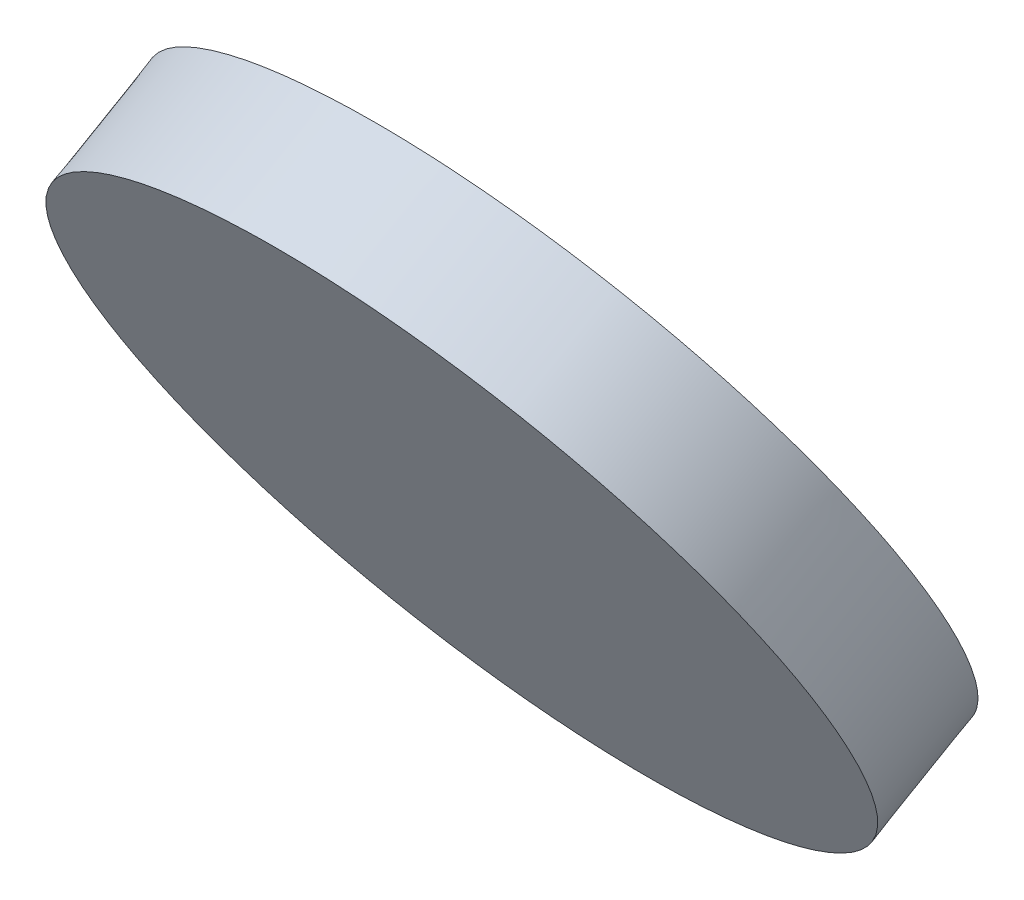
ISO-10303-21;
HEADER;
FILE_DESCRIPTION(('STEP AP214'),'2;1');
FILE_NAME('part.step','',(''),(''),'','','');
FILE_SCHEMA(('AUTOMOTIVE_DESIGN { 1 0 10303 214 1 1 1 1 }'));
ENDSEC;
DATA;
#1=APPLICATION_CONTEXT('core data for automotive mechanical design processes');
#2=APPLICATION_PROTOCOL_DEFINITION('international standard','automotive_design',2000,#1);
#3=PRODUCT_CONTEXT('',#1,'mechanical');
#4=PRODUCT('Part','Part','',(#3));
#5=PRODUCT_RELATED_PRODUCT_CATEGORY('part','',(#4));
#6=PRODUCT_DEFINITION_FORMATION('','',#4);
#7=PRODUCT_DEFINITION_CONTEXT('part definition',#1,'design');
#8=PRODUCT_DEFINITION('design','',#6,#7);
#9=PRODUCT_DEFINITION_SHAPE('','',#8);
#10=(LENGTH_UNIT() NAMED_UNIT(*) SI_UNIT(.MILLI.,.METRE.));
#11=(NAMED_UNIT(*) PLANE_ANGLE_UNIT() SI_UNIT($,.RADIAN.));
#12=(NAMED_UNIT(*) SI_UNIT($,.STERADIAN.) SOLID_ANGLE_UNIT());
#13=UNCERTAINTY_MEASURE_WITH_UNIT(LENGTH_MEASURE(1.E-05),#10,'distance_accuracy_value','');
#14=(GEOMETRIC_REPRESENTATION_CONTEXT(3) GLOBAL_UNCERTAINTY_ASSIGNED_CONTEXT((#13)) GLOBAL_UNIT_ASSIGNED_CONTEXT((#10,
#11,#12)) REPRESENTATION_CONTEXT('',''));
#15=CARTESIAN_POINT('',(0.,0.,0.));
#16=DIRECTION('',(0.,0.,1.));
#17=DIRECTION('',(1.,0.,0.));
#18=AXIS2_PLACEMENT_3D('',#15,#16,#17);
#19=CARTESIAN_POINT('',(-12.5,13.3879679238206,-41.0328048076007));
#20=CARTESIAN_POINT('',(-12.3317700207924,13.3879679238206,-41.0328048076007));
#21=CARTESIAN_POINT('',(-11.9953100623771,13.3300082670677,-41.0662678310291));
#22=CARTESIAN_POINT('',(-11.5674545927316,13.0824255601822,-41.2092097734962));
#23=CARTESIAN_POINT('',(-11.2815707077975,12.7118918543211,-41.4231375083189));
#24=CARTESIAN_POINT('',(-11.1811816375123,12.2748175473052,-41.6754824771303));
#25=CARTESIAN_POINT('',(-11.2815707077975,11.8377432402894,-41.9278274459418));
#26=CARTESIAN_POINT('',(-11.5674545927316,11.4672095344283,-42.1417551807645));
#27=CARTESIAN_POINT('',(-11.9953100623771,11.2196268275428,-42.2846971232316));
#28=CARTESIAN_POINT('',(-12.5,11.1326873424135,-42.3348916583742));
#29=CARTESIAN_POINT('',(-13.0046899376229,11.2196268275428,-42.2846971232316));
#30=CARTESIAN_POINT('',(-13.4325454072684,11.4672095344283,-42.1417551807646));
#31=CARTESIAN_POINT('',(-13.7184292922025,11.8377432402894,-41.9278274459418));
#32=CARTESIAN_POINT('',(-13.8188183624877,12.2748175473052,-41.6754824771303));
#33=CARTESIAN_POINT('',(-13.7184292922025,12.7118918543211,-41.4231375083189));
#34=CARTESIAN_POINT('',(-13.4325454072684,13.0824255601822,-41.2092097734962));
#35=CARTESIAN_POINT('',(-13.0046899376229,13.3300082670677,-41.0662678310291));
#36=CARTESIAN_POINT('',(-12.6682299792076,13.3879679238206,-41.0328048076007));
#37=CARTESIAN_POINT('',(-12.5,13.3879679238206,-41.0328048076007));
#38=B_SPLINE_CURVE_WITH_KNOTS('',3,(#19,#20,#21,#22,#23,#24,#25,#26,#27,#28,#29,#30,#31,#32,#33,
#34,#35,#36,#37),.UNSPECIFIED.,.T.,.F.,(4,1,1,1,1,1,1,1,1,1,1,1,1,1,1,1,4),(0.,
0.0624999999999999,0.125,0.1875,0.25,0.312499999999999,0.375,0.4375,0.5,0.5625,
0.624999999999999,0.6875,0.75,0.8125,0.875,0.9375,1.),.UNSPECIFIED.);
#39=DIRECTION('',(0.,0.499999999999995,-0.866025403784442));
#40=VECTOR('',#39,1.);
#41=SURFACE_OF_LINEAR_EXTRUSION('',#38,#40);
#42=CARTESIAN_POINT('',(-12.5,13.3879679238206,-41.0328048076007));
#43=CARTESIAN_POINT('',(-12.3317700207924,13.3879679238206,-41.0328048076007));
#44=CARTESIAN_POINT('',(-11.9953100623771,13.3300082670677,-41.0662678310291));
#45=CARTESIAN_POINT('',(-11.5674545927316,13.0824255601822,-41.2092097734962));
#46=CARTESIAN_POINT('',(-11.2815707077975,12.7118918543211,-41.4231375083189));
#47=CARTESIAN_POINT('',(-11.1811816375123,12.2748175473052,-41.6754824771303));
#48=CARTESIAN_POINT('',(-11.2815707077975,11.8377432402894,-41.9278274459418));
#49=CARTESIAN_POINT('',(-11.5674545927316,11.4672095344283,-42.1417551807645));
#50=CARTESIAN_POINT('',(-11.9953100623771,11.2196268275428,-42.2846971232316));
#51=CARTESIAN_POINT('',(-12.5,11.1326873424135,-42.3348916583742));
#52=CARTESIAN_POINT('',(-13.0046899376229,11.2196268275428,-42.2846971232316));
#53=CARTESIAN_POINT('',(-13.4325454072684,11.4672095344283,-42.1417551807646));
#54=CARTESIAN_POINT('',(-13.7184292922025,11.8377432402894,-41.9278274459418));
#55=CARTESIAN_POINT('',(-13.8188183624877,12.2748175473052,-41.6754824771303));
#56=CARTESIAN_POINT('',(-13.7184292922025,12.7118918543211,-41.4231375083189));
#57=CARTESIAN_POINT('',(-13.4325454072684,13.0824255601822,-41.2092097734962));
#58=CARTESIAN_POINT('',(-13.0046899376229,13.3300082670677,-41.0662678310291));
#59=CARTESIAN_POINT('',(-12.6682299792076,13.3879679238206,-41.0328048076007));
#60=CARTESIAN_POINT('',(-12.5,13.3879679238206,-41.0328048076007));
#61=B_SPLINE_CURVE_WITH_KNOTS('',3,(#42,#43,#44,#45,#46,#47,#48,#49,#50,#51,#52,#53,#54,#55,#56,
#57,#58,#59,#60),.UNSPECIFIED.,.T.,.F.,(4,1,1,1,1,1,1,1,1,1,1,1,1,1,1,1,4),(0.,
0.0624999999999999,0.125,0.1875,0.25,0.312499999999999,0.375,0.4375,0.5,0.5625,
0.624999999999999,0.6875,0.75,0.8125,0.875,0.9375,1.),.UNSPECIFIED.);
#62=CARTESIAN_POINT('',(-12.5,13.3879679238206,-41.0328048076007));
#63=VERTEX_POINT('',#62);
#64=EDGE_CURVE('E10',#63,#63,#61,.T.);
#65=ORIENTED_EDGE('',*,*,#64,.T.);
#66=EDGE_LOOP('',(#65));
#67=FACE_BOUND('',#66,.T.);
#68=CARTESIAN_POINT('',(-12.5,13.5879679238206,-41.3792149691145));
#69=CARTESIAN_POINT('',(-12.5210292435893,13.5879679370051,-41.3792149615024));
#70=CARTESIAN_POINT('',(-12.5420580506909,13.5875150942108,-41.3794764104116));
#71=CARTESIAN_POINT('',(-12.5840656469514,13.5857124585183,-41.3805171626139));
#72=CARTESIAN_POINT('',(-12.605044433095,13.5843626128516,-41.3812964963729));
#73=CARTESIAN_POINT('',(-12.6469017924796,13.5807746122206,-41.3833680295031));
#74=CARTESIAN_POINT('',(-12.6677803587443,13.578536396298,-41.3846602640685));
#75=CARTESIAN_POINT('',(-12.7093873858979,13.5731802652805,-41.3877526277533));
#76=CARTESIAN_POINT('',(-12.7301158402734,13.5700623122453,-41.3895527787775));
#77=CARTESIAN_POINT('',(-12.7713726611837,13.5629552823521,-41.3936560243994));
#78=CARTESIAN_POINT('',(-12.7919010277185,13.5589662054942,-41.3959591189972));
#79=CARTESIAN_POINT('',(-12.832707709252,13.5501254880213,-41.40106330961));
#80=CARTESIAN_POINT('',(-12.8529860349978,13.5452738846176,-41.4038643841411));
#81=CARTESIAN_POINT('',(-12.8932426430212,13.5347166816437,-41.40995958812));
#82=CARTESIAN_POINT('',(-12.9132209457939,13.529011140702,-41.4132536837186));
#83=CARTESIAN_POINT('',(-12.9528275830444,13.5167546200185,-41.4203299892345));
#84=CARTESIAN_POINT('',(-12.9724559380415,13.5102036900331,-41.424112170425));
#85=CARTESIAN_POINT('',(-13.0113124478785,13.4962651035168,-41.4321596171023));
#86=CARTESIAN_POINT('',(-13.0305406027184,13.4888774469859,-41.4364248825891));
#87=CARTESIAN_POINT('',(-13.06855413176,13.4732901029195,-41.4454242398818));
#88=CARTESIAN_POINT('',(-13.0873394798451,13.4650903676354,-41.4501583592553));
#89=CARTESIAN_POINT('',(-13.1244251203754,13.4479034004617,-41.4600812593796));
#90=CARTESIAN_POINT('',(-13.1427253794428,13.4389161145649,-41.4652700713115));
#91=CARTESIAN_POINT('',(-13.1787984767248,13.4201785584249,-41.4760882043928));
#92=CARTESIAN_POINT('',(-13.1965712921558,13.4104282552884,-41.4817175445334));
#93=CARTESIAN_POINT('',(-13.2315471338735,13.3901891460976,-41.4934025996728));
#94=CARTESIAN_POINT('',(-13.2487501601601,13.3797003400433,-41.4994583146718));
#95=CARTESIAN_POINT('',(-13.2825440403118,13.3580086937487,-41.5119819924991));
#96=CARTESIAN_POINT('',(-13.2991349205488,13.3468058843255,-41.5184499375353));
#97=CARTESIAN_POINT('',(-13.331662109414,13.3237107142865,-41.5317839401743));
#98=CARTESIAN_POINT('',(-13.3475984628843,13.3118184010442,-41.538649970426));
#99=CARTESIAN_POINT('',(-13.3787742546724,13.287368675224,-41.5527660262099));
#100=CARTESIAN_POINT('',(-13.3940137339341,13.2748113018148,-41.560016029128));
#101=CARTESIAN_POINT('',(-13.4237532190322,13.2490561522244,-41.5748857716771));
#102=CARTESIAN_POINT('',(-13.4382532248685,13.2358583760433,-41.5825055113079));
#103=CARTESIAN_POINT('',(-13.4664853364362,13.2088593483717,-41.598093407202));
#104=CARTESIAN_POINT('',(-13.4802173969397,13.1950580614227,-41.6060615839371));
#105=CARTESIAN_POINT('',(-13.5068854022177,13.1668886895517,-41.6223251783698));
#106=CARTESIAN_POINT('',(-13.5198212922901,13.1525205657954,-41.6306206184882));
#107=CARTESIAN_POINT('',(-13.5448686479447,13.1232542070916,-41.6475175585641));
#108=CARTESIAN_POINT('',(-13.5569800779426,13.1083559493053,-41.6561190717074));
#109=CARTESIAN_POINT('',(-13.5803501882216,13.0780659818592,-41.6736069925662));
#110=CARTESIAN_POINT('',(-13.5916088685026,13.0626742721992,-41.6824934002817));
#111=CARTESIAN_POINT('',(-13.6132451346653,13.0314340535596,-41.7005299489228));
#112=CARTESIAN_POINT('',(-13.623622758529,13.015585564311,-41.7096800784567));
#113=CARTESIAN_POINT('',(-13.6434685587776,12.983468457497,-41.7282228987214));
#114=CARTESIAN_POINT('',(-13.6529367975248,12.9671998688375,-41.7376155727632));
#115=CARTESIAN_POINT('',(-13.67093551211,12.9342791869969,-41.7566223372858));
#116=CARTESIAN_POINT('',(-13.6794660430833,12.9176271164334,-41.7662364147082));
#117=CARTESIAN_POINT('',(-13.6955609364387,12.8839763918238,-41.78566466962));
#118=CARTESIAN_POINT('',(-13.7031252988208,12.8669777377776,-41.7954788471094));
#119=CARTESIAN_POINT('',(-13.7172779098496,12.8326773837169,-41.8152821657597));
#120=CARTESIAN_POINT('',(-13.7238661010426,12.8153756659321,-41.8252713171802));
#121=CARTESIAN_POINT('',(-13.7360565090117,12.7805124208753,-41.8453996210986));
#122=CARTESIAN_POINT('',(-13.7416586580894,12.7629508758539,-41.855538783844));
#123=CARTESIAN_POINT('',(-13.7518670392729,12.7276112523987,-41.875942124959));
#124=CARTESIAN_POINT('',(-13.7564732284109,12.7098331646577,-41.8862063087019));
#125=CARTESIAN_POINT('',(-13.7646797198118,12.6741037119205,-41.9068347178577));
#126=CARTESIAN_POINT('',(-13.7682800220747,12.6561523469245,-41.9171989432705));
#127=CARTESIAN_POINT('',(-13.7744647488583,12.6201195960344,-41.9380024616965));
#128=CARTESIAN_POINT('',(-13.7770492171889,12.6020382157818,-41.9484417514527));
#129=CARTESIAN_POINT('',(-13.7811922856357,12.5657887105628,-41.9693704130489));
#130=CARTESIAN_POINT('',(-13.7827509561402,12.5476205916345,-41.9798597814028));
#131=CARTESIAN_POINT('',(-13.7848324523857,12.5112408291569,-42.0008636470623));
#132=CARTESIAN_POINT('',(-13.7853553390593,12.4930291882311,-42.0113781428532));
#133=CARTESIAN_POINT('',(-13.7853553390593,12.4566059063794,-42.032407134435));
#134=CARTESIAN_POINT('',(-13.7848324523857,12.4383942654536,-42.042921630226));
#135=CARTESIAN_POINT('',(-13.7827509561402,12.402014502976,-42.0639254958854));
#136=CARTESIAN_POINT('',(-13.7811922856357,12.3838463840476,-42.0744148642394));
#137=CARTESIAN_POINT('',(-13.7770492171889,12.3475968788287,-42.0953435258355));
#138=CARTESIAN_POINT('',(-13.7744647488583,12.3295154985761,-42.1057828155917));
#139=CARTESIAN_POINT('',(-13.7682800220747,12.293482747686,-42.1265863340177));
#140=CARTESIAN_POINT('',(-13.7646797198118,12.2755313826899,-42.1369505594305));
#141=CARTESIAN_POINT('',(-13.7564732284109,12.2398019299528,-42.1575789685863));
#142=CARTESIAN_POINT('',(-13.7518670392729,12.2220238422118,-42.1678431523293));
#143=CARTESIAN_POINT('',(-13.7416586580894,12.1866842187565,-42.1882464934442));
#144=CARTESIAN_POINT('',(-13.7360565090117,12.1691226737352,-42.1983856561897));
#145=CARTESIAN_POINT('',(-13.7238661010426,12.1342594286783,-42.2185139601081));
#146=CARTESIAN_POINT('',(-13.7172779098496,12.1169577108936,-42.2285031115286));
#147=CARTESIAN_POINT('',(-13.7031252988208,12.0826573568328,-42.2483064301788));
#148=CARTESIAN_POINT('',(-13.6955609364387,12.0656587027867,-42.2581206076682));
#149=CARTESIAN_POINT('',(-13.6794660430833,12.032007978177,-42.27754886258));
#150=CARTESIAN_POINT('',(-13.67093551211,12.0153559076135,-42.2871629400024));
#151=CARTESIAN_POINT('',(-13.6529367975248,11.9824352257729,-42.306169704525));
#152=CARTESIAN_POINT('',(-13.6434685587776,11.9661666371135,-42.3155623785669));
#153=CARTESIAN_POINT('',(-13.623622758529,11.9340495302994,-42.3341051988316));
#154=CARTESIAN_POINT('',(-13.6132451346653,11.9182010410509,-42.3432553283655));
#155=CARTESIAN_POINT('',(-13.5916088685026,11.8869608224113,-42.3612918770066));
#156=CARTESIAN_POINT('',(-13.5803501882216,11.8715691127513,-42.3701782847221));
#157=CARTESIAN_POINT('',(-13.5569800779426,11.8412791453051,-42.3876662055809));
#158=CARTESIAN_POINT('',(-13.5448686479447,11.8263808875189,-42.3962677187242));
#159=CARTESIAN_POINT('',(-13.5198212922901,11.7971145288151,-42.4131646588));
#160=CARTESIAN_POINT('',(-13.5068854022177,11.7827464050587,-42.4214600989185));
#161=CARTESIAN_POINT('',(-13.4802173969397,11.7545770331877,-42.4377236933511));
#162=CARTESIAN_POINT('',(-13.4664853364362,11.7407757462388,-42.4456918700863));
#163=CARTESIAN_POINT('',(-13.4382532248685,11.7137767185672,-42.4612797659803));
#164=CARTESIAN_POINT('',(-13.4237532190322,11.7005789423861,-42.4688995056112));
#165=CARTESIAN_POINT('',(-13.3940137339341,11.6748237927957,-42.4837692481602));
#166=CARTESIAN_POINT('',(-13.3787742546724,11.6622664193864,-42.4910192510784));
#167=CARTESIAN_POINT('',(-13.3475984628843,11.6378166935663,-42.5051353068622));
#168=CARTESIAN_POINT('',(-13.331662109414,11.625924380324,-42.512001337114));
#169=CARTESIAN_POINT('',(-13.2991349205488,11.602829210285,-42.525335339753));
#170=CARTESIAN_POINT('',(-13.2825440403118,11.5916264008617,-42.5318032847892));
#171=CARTESIAN_POINT('',(-13.2487501601601,11.5699347545672,-42.5443269626165));
#172=CARTESIAN_POINT('',(-13.2315471338735,11.5594459485129,-42.5503826776154));
#173=CARTESIAN_POINT('',(-13.1965712921558,11.5392068393221,-42.5620677327549));
#174=CARTESIAN_POINT('',(-13.1787984767249,11.5294565361856,-42.5676970728955));
#175=CARTESIAN_POINT('',(-13.1427253794427,11.5107189800456,-42.5785152059768));
#176=CARTESIAN_POINT('',(-13.1244251203749,11.5017316941488,-42.5837040179086));
#177=CARTESIAN_POINT('',(-13.0873394798455,11.484544726975,-42.593626918033));
#178=CARTESIAN_POINT('',(-13.0685541317618,11.4763449916909,-42.5983610374065));
#179=CARTESIAN_POINT('',(-13.0305406027166,11.4607576476247,-42.6073603946991));
#180=CARTESIAN_POINT('',(-13.0113124478718,11.453369991094,-42.6116256601858));
#181=CARTESIAN_POINT('',(-12.9724559380482,11.439431404577,-42.6196731068635));
#182=CARTESIAN_POINT('',(-12.9528275830694,11.4328804745907,-42.6234552880545));
#183=CARTESIAN_POINT('',(-12.9132209457689,11.4206239539098,-42.6305315935689));
#184=CARTESIAN_POINT('',(-12.8932426429279,11.4149184129717,-42.6338256891654));
#185=CARTESIAN_POINT('',(-12.8529860350911,11.404361209988,-42.63992089315));
#186=CARTESIAN_POINT('',(-12.8327077096002,11.3995096065709,-42.6427219676888));
#187=CARTESIAN_POINT('',(-12.7919010273703,11.3906688891345,-42.6478261582806));
#188=CARTESIAN_POINT('',(-12.7713726598844,11.3866798123263,-42.6501292528496));
#189=CARTESIAN_POINT('',(-12.7301158415728,11.3795727822972,-42.65423249855));
#190=CARTESIAN_POINT('',(-12.7093873907472,11.3764548290763,-42.6560326496815));
#191=CARTESIAN_POINT('',(-12.6677803538952,11.3710986985662,-42.6591250130733));
#192=CARTESIAN_POINT('',(-12.6469017743828,11.3688604833367,-42.6604172472386));
#193=CARTESIAN_POINT('',(-12.6050444511905,11.3652724808121,-42.662488781462));
#194=CARTESIAN_POINT('',(-12.5840657144826,11.3639226325591,-42.6632681167142));
#195=CARTESIAN_POINT('',(-12.5420579831637,11.3621200039326,-42.6643088648369));
#196=CARTESIAN_POINT('',(-12.5210289915818,11.3616671707899,-42.6645703081738));
#197=CARTESIAN_POINT('',(-12.4789710084182,11.3616671707899,-42.6645703081738));
#198=CARTESIAN_POINT('',(-12.4579420168363,11.3621200039326,-42.664308864837));
#199=CARTESIAN_POINT('',(-12.4159342855174,11.3639226325591,-42.6632681167142));
#200=CARTESIAN_POINT('',(-12.3949555488095,11.3652724808121,-42.662488781462));
#201=CARTESIAN_POINT('',(-12.3530982256172,11.3688604833367,-42.6604172472385));
#202=CARTESIAN_POINT('',(-12.3322196461048,11.3710986985662,-42.6591250130733));
#203=CARTESIAN_POINT('',(-12.2906126092528,11.3764548290763,-42.6560326496815));
#204=CARTESIAN_POINT('',(-12.2698841584272,11.3795727822972,-42.65423249855));
#205=CARTESIAN_POINT('',(-12.2286273401156,11.3866798123263,-42.6501292528496));
#206=CARTESIAN_POINT('',(-12.2080989726297,11.3906688891345,-42.6478261582806));
#207=CARTESIAN_POINT('',(-12.1672922903998,11.3995096065709,-42.6427219676888));
#208=CARTESIAN_POINT('',(-12.1470139649089,11.404361209988,-42.63992089315));
#209=CARTESIAN_POINT('',(-12.1067573570721,11.4149184129717,-42.6338256891654));
#210=CARTESIAN_POINT('',(-12.0867790542311,11.4206239539098,-42.630531593569));
#211=CARTESIAN_POINT('',(-12.0471724169306,11.4328804745907,-42.6234552880545));
#212=CARTESIAN_POINT('',(-12.0275440619518,11.439431404577,-42.6196731068635));
#213=CARTESIAN_POINT('',(-11.9886875521282,11.453369991094,-42.6116256601858));
#214=CARTESIAN_POINT('',(-11.9694593972834,11.4607576476247,-42.6073603946991));
#215=CARTESIAN_POINT('',(-11.9314458682382,11.4763449916909,-42.5983610374065));
#216=CARTESIAN_POINT('',(-11.9126605201545,11.484544726975,-42.593626918033));
#217=CARTESIAN_POINT('',(-11.8755748796251,11.5017316941488,-42.5837040179086));
#218=CARTESIAN_POINT('',(-11.8572746205573,11.5107189800456,-42.5785152059768));
#219=CARTESIAN_POINT('',(-11.8212015232751,11.5294565361856,-42.5676970728954));
#220=CARTESIAN_POINT('',(-11.8034287078442,11.539206839322,-42.5620677327549));
#221=CARTESIAN_POINT('',(-11.7684528661265,11.5594459485129,-42.5503826776154));
#222=CARTESIAN_POINT('',(-11.7512498398399,11.5699347545672,-42.5443269626165));
#223=CARTESIAN_POINT('',(-11.7174559596882,11.5916264008617,-42.5318032847892));
#224=CARTESIAN_POINT('',(-11.7008650794512,11.602829210285,-42.5253353397529));
#225=CARTESIAN_POINT('',(-11.668337890586,11.625924380324,-42.512001337114));
#226=CARTESIAN_POINT('',(-11.6524015371157,11.6378166935663,-42.5051353068622));
#227=CARTESIAN_POINT('',(-11.6212257453276,11.6622664193864,-42.4910192510784));
#228=CARTESIAN_POINT('',(-11.6059862660658,11.6748237927957,-42.4837692481602));
#229=CARTESIAN_POINT('',(-11.5762467809678,11.7005789423861,-42.4688995056112));
#230=CARTESIAN_POINT('',(-11.5617467751315,11.7137767185672,-42.4612797659803));
#231=CARTESIAN_POINT('',(-11.5335146635638,11.7407757462388,-42.4456918700863));
#232=CARTESIAN_POINT('',(-11.5197826030603,11.7545770331877,-42.4377236933511));
#233=CARTESIAN_POINT('',(-11.4931145977823,11.7827464050587,-42.4214600989185));
#234=CARTESIAN_POINT('',(-11.4801787077099,11.7971145288151,-42.4131646588));
#235=CARTESIAN_POINT('',(-11.4551313520553,11.8263808875189,-42.3962677187242));
#236=CARTESIAN_POINT('',(-11.4430199220574,11.8412791453051,-42.3876662055809));
#237=CARTESIAN_POINT('',(-11.4196498117784,11.8715691127513,-42.3701782847221));
#238=CARTESIAN_POINT('',(-11.4083911314973,11.8869608224113,-42.3612918770066));
#239=CARTESIAN_POINT('',(-11.3867548653347,11.9182010410509,-42.3432553283655));
#240=CARTESIAN_POINT('',(-11.376377241471,11.9340495302994,-42.3341051988316));
#241=CARTESIAN_POINT('',(-11.3565314412224,11.9661666371135,-42.3155623785669));
#242=CARTESIAN_POINT('',(-11.3470632024752,11.9824352257729,-42.306169704525));
#243=CARTESIAN_POINT('',(-11.32906448789,12.0153559076135,-42.2871629400024));
#244=CARTESIAN_POINT('',(-11.3205339569167,12.032007978177,-42.27754886258));
#245=CARTESIAN_POINT('',(-11.3044390635613,12.0656587027867,-42.2581206076682));
#246=CARTESIAN_POINT('',(-11.2968747011792,12.0826573568328,-42.2483064301788));
#247=CARTESIAN_POINT('',(-11.2827220901504,12.1169577108936,-42.2285031115286));
#248=CARTESIAN_POINT('',(-11.2761338989574,12.1342594286783,-42.2185139601081));
#249=CARTESIAN_POINT('',(-11.2639434909883,12.1691226737352,-42.1983856561897));
#250=CARTESIAN_POINT('',(-11.2583413419106,12.1866842187565,-42.1882464934442));
#251=CARTESIAN_POINT('',(-11.2481329607271,12.2220238422118,-42.1678431523293));
#252=CARTESIAN_POINT('',(-11.2435267715891,12.2398019299528,-42.1575789685863));
#253=CARTESIAN_POINT('',(-11.2353202801882,12.2755313826899,-42.1369505594305));
#254=CARTESIAN_POINT('',(-11.2317199779253,12.293482747686,-42.1265863340177));
#255=CARTESIAN_POINT('',(-11.2255352511416,12.3295154985761,-42.1057828155917));
#256=CARTESIAN_POINT('',(-11.2229507828111,12.3475968788287,-42.0953435258356));
#257=CARTESIAN_POINT('',(-11.2188077143643,12.3838463840476,-42.0744148642394));
#258=CARTESIAN_POINT('',(-11.2172490438598,12.402014502976,-42.0639254958854));
#259=CARTESIAN_POINT('',(-11.2151675476143,12.4383942654536,-42.042921630226));
#260=CARTESIAN_POINT('',(-11.2146446609407,12.4566059063794,-42.032407134435));
#261=CARTESIAN_POINT('',(-11.2146446609407,12.4930291882311,-42.0113781428532));
#262=CARTESIAN_POINT('',(-11.2151675476143,12.5112408291569,-42.0008636470623));
#263=CARTESIAN_POINT('',(-11.2172490438598,12.5476205916345,-41.9798597814028));
#264=CARTESIAN_POINT('',(-11.2188077143643,12.5657887105628,-41.9693704130489));
#265=CARTESIAN_POINT('',(-11.2229507828111,12.6020382157818,-41.9484417514527));
#266=CARTESIAN_POINT('',(-11.2255352511416,12.6201195960344,-41.9380024616965));
#267=CARTESIAN_POINT('',(-11.2317199779253,12.6561523469245,-41.9171989432705));
#268=CARTESIAN_POINT('',(-11.2353202801882,12.6741037119205,-41.9068347178577));
#269=CARTESIAN_POINT('',(-11.2435267715891,12.7098331646577,-41.8862063087019));
#270=CARTESIAN_POINT('',(-11.2481329607271,12.7276112523987,-41.875942124959));
#271=CARTESIAN_POINT('',(-11.2583413419106,12.7629508758539,-41.855538783844));
#272=CARTESIAN_POINT('',(-11.2639434909883,12.7805124208753,-41.8453996210986));
#273=CARTESIAN_POINT('',(-11.2761338989574,12.8153756659322,-41.8252713171802));
#274=CARTESIAN_POINT('',(-11.2827220901504,12.8326773837169,-41.8152821657597));
#275=CARTESIAN_POINT('',(-11.2968747011792,12.8669777377776,-41.7954788471094));
#276=CARTESIAN_POINT('',(-11.3044390635613,12.8839763918238,-41.78566466962));
#277=CARTESIAN_POINT('',(-11.3205339569167,12.9176271164334,-41.7662364147082));
#278=CARTESIAN_POINT('',(-11.32906448789,12.9342791869969,-41.7566223372858));
#279=CARTESIAN_POINT('',(-11.3470632024752,12.9671998688375,-41.7376155727633));
#280=CARTESIAN_POINT('',(-11.3565314412224,12.983468457497,-41.7282228987214));
#281=CARTESIAN_POINT('',(-11.376377241471,13.015585564311,-41.7096800784567));
#282=CARTESIAN_POINT('',(-11.3867548653347,13.0314340535596,-41.7005299489228));
#283=CARTESIAN_POINT('',(-11.4083911314973,13.0626742721992,-41.6824934002817));
#284=CARTESIAN_POINT('',(-11.4196498117784,13.0780659818592,-41.6736069925662));
#285=CARTESIAN_POINT('',(-11.4430199220574,13.1083559493053,-41.6561190717074));
#286=CARTESIAN_POINT('',(-11.4551313520553,13.1232542070916,-41.6475175585641));
#287=CARTESIAN_POINT('',(-11.4801787077099,13.1525205657954,-41.6306206184882));
#288=CARTESIAN_POINT('',(-11.4931145977823,13.1668886895517,-41.6223251783697));
#289=CARTESIAN_POINT('',(-11.5197826030603,13.1950580614227,-41.6060615839371));
#290=CARTESIAN_POINT('',(-11.5335146635638,13.2088593483717,-41.598093407202));
#291=CARTESIAN_POINT('',(-11.5617467751315,13.2358583760433,-41.582505511308));
#292=CARTESIAN_POINT('',(-11.5762467809678,13.2490561522244,-41.5748857716771));
#293=CARTESIAN_POINT('',(-11.6059862660659,13.2748113018148,-41.560016029128));
#294=CARTESIAN_POINT('',(-11.6212257453276,13.287368675224,-41.5527660262099));
#295=CARTESIAN_POINT('',(-11.6524015371157,13.3118184010442,-41.538649970426));
#296=CARTESIAN_POINT('',(-11.668337890586,13.3237107142865,-41.5317839401743));
#297=CARTESIAN_POINT('',(-11.7008650794512,13.3468058843255,-41.5184499375353));
#298=CARTESIAN_POINT('',(-11.7174559596882,13.3580086937487,-41.5119819924991));
#299=CARTESIAN_POINT('',(-11.7512498398399,13.3797003400433,-41.4994583146718));
#300=CARTESIAN_POINT('',(-11.7684528661265,13.3901891460976,-41.4934025996728));
#301=CARTESIAN_POINT('',(-11.8034287078442,13.4104282552884,-41.4817175445334));
#302=CARTESIAN_POINT('',(-11.8212015232752,13.4201785584249,-41.4760882043928));
#303=CARTESIAN_POINT('',(-11.8572746205572,13.4389161145649,-41.4652700713115));
#304=CARTESIAN_POINT('',(-11.8755748796246,13.4479034004617,-41.4600812593796));
#305=CARTESIAN_POINT('',(-11.9126605201549,13.4650903676354,-41.4501583592553));
#306=CARTESIAN_POINT('',(-11.93144586824,13.4732901029195,-41.4454242398818));
#307=CARTESIAN_POINT('',(-11.9694593972816,13.4888774469859,-41.4364248825891));
#308=CARTESIAN_POINT('',(-11.9886875521215,13.4962651035168,-41.4321596171023));
#309=CARTESIAN_POINT('',(-12.0275440619585,13.5102036900331,-41.424112170425));
#310=CARTESIAN_POINT('',(-12.0471724169556,13.5167546200185,-41.4203299892345));
#311=CARTESIAN_POINT('',(-12.0867790542061,13.529011140702,-41.4132536837186));
#312=CARTESIAN_POINT('',(-12.1067573569788,13.5347166816437,-41.40995958812));
#313=CARTESIAN_POINT('',(-12.1470139650022,13.5452738846176,-41.4038643841411));
#314=CARTESIAN_POINT('',(-12.167292290748,13.5501254880213,-41.40106330961));
#315=CARTESIAN_POINT('',(-12.2080989722815,13.5589662054942,-41.3959591189972));
#316=CARTESIAN_POINT('',(-12.2286273388163,13.5629552823521,-41.3936560243994));
#317=CARTESIAN_POINT('',(-12.2698841597265,13.5700623122453,-41.3895527787775));
#318=CARTESIAN_POINT('',(-12.2906126141021,13.5731802652805,-41.3877526277533));
#319=CARTESIAN_POINT('',(-12.3322196412557,13.578536396298,-41.3846602640685));
#320=CARTESIAN_POINT('',(-12.3530982075204,13.5807746122206,-41.3833680295031));
#321=CARTESIAN_POINT('',(-12.394955566905,13.5843626128517,-41.3812964963729));
#322=CARTESIAN_POINT('',(-12.4159343530485,13.5857124585183,-41.3805171626139));
#323=CARTESIAN_POINT('',(-12.4579419493091,13.5875150942108,-41.3794764104116));
#324=CARTESIAN_POINT('',(-12.4789707564107,13.5879679370051,-41.3792149615024));
#325=CARTESIAN_POINT('',(-12.5,13.5879679238206,-41.3792149691145));
#326=B_SPLINE_CURVE_WITH_KNOTS('',3,(#68,#69,#70,#71,#72,#73,#74,#75,#76,#77,#78,#79,#80,#81,
#82,#83,#84,#85,#86,#87,#88,#89,#90,#91,#92,#93,#94,#95,#96,#97,#98,#99,#100,#101,#102,#103,
#104,#105,#106,#107,#108,#109,#110,#111,#112,#113,#114,#115,#116,#117,#118,#119,#120,#121,#122,
#123,#124,#125,#126,#127,#128,#129,#130,#131,#132,#133,#134,#135,#136,#137,#138,#139,#140,#141,
#142,#143,#144,#145,#146,#147,#148,#149,#150,#151,#152,#153,#154,#155,#156,#157,#158,#159,#160,
#161,#162,#163,#164,#165,#166,#167,#168,#169,#170,#171,#172,#173,#174,#175,#176,#177,#178,#179,
#180,#181,#182,#183,#184,#185,#186,#187,#188,#189,#190,#191,#192,#193,#194,#195,#196,#197,#198,
#199,#200,#201,#202,#203,#204,#205,#206,#207,#208,#209,#210,#211,#212,#213,#214,#215,#216,#217,
#218,#219,#220,#221,#222,#223,#224,#225,#226,#227,#228,#229,#230,#231,#232,#233,#234,#235,#236,
#237,#238,#239,#240,#241,#242,#243,#244,#245,#246,#247,#248,#249,#250,#251,#252,#253,#254,#255,
#256,#257,#258,#259,#260,#261,#262,#263,#264,#265,#266,#267,#268,#269,#270,#271,#272,#273,#274,
#275,#276,#277,#278,#279,#280,#281,#282,#283,#284,#285,#286,#287,#288,#289,#290,#291,#292,#293,
#294,#295,#296,#297,#298,#299,#300,#301,#302,#303,#304,#305,#306,#307,#308,#309,#310,#311,#312,
#313,#314,#315,#316,#317,#318,#319,#320,#321,#322,#323,#324,#325),.UNSPECIFIED.,.F.,.F.,(4,2,2,
2,2,2,2,2,2,2,2,2,2,2,2,2,2,2,2,2,2,2,2,2,2,2,2,2,2,2,2,2,2,2,2,2,2,2,2,2,2,2,2,2,2,2,2,2,2,2,2,
2,2,2,2,2,2,2,2,2,2,2,2,2,2,2,2,2,2,2,2,2,2,2,2,2,2,2,2,2,2,2,2,2,2,2,2,2,2,2,2,2,2,2,2,2,2,2,2,
2,2,2,2,2,2,2,2,2,2,2,2,2,2,2,2,2,2,2,2,2,2,2,2,2,2,2,2,2,4),(0.,0.0630806127990774,
0.126164936809588,0.189253590290846,0.252344965001653,0.31543633971246,0.378524993193718,
0.441609317204225,0.504689930003307,0.567770542802381,0.630854866812894,0.693943520294153,
0.757034895004958,0.820126269715766,0.883214923197023,0.946299247207535,1.00937986000662,
1.07246047280569,1.1355447968162,1.19863345029746,1.26172482500827,1.32481619971907,
1.38790485320033,1.45098917721084,1.51406979000992,1.577150402809,1.6402347268195,
1.70332338030076,1.76641475501157,1.82950612972237,1.89259478320363,1.95567910721414,
2.01875972001322,2.0818403328123,2.14492465682281,2.20801331030406,2.27110468501487,
2.33419605972568,2.39728471320694,2.46036903721745,2.52344965001653,2.58653026281561,
2.64961458682611,2.71270324030737,2.77579461501818,2.83888598972898,2.90197464321025,
2.96505896722075,3.02813958001983,3.09122019281891,3.15430451682942,3.21739317031068,
3.28048454502148,3.34357591973229,3.40666457321355,3.46974889722406,3.53282951002314,
3.59591012282222,3.65899444683273,3.72208310031398,3.78517447502479,3.84826584973559,
3.91135450321686,3.97443882722736,4.03751944002644,4.10060005282552,4.16368437683603,
4.22677303031729,4.2898644050281,4.3529557797389,4.41604443322016,4.47912875723067,
4.54220937002975,4.60528998282883,4.66837430683933,4.7314629603206,4.7945543350314,
4.85764570974221,4.92073436322347,4.98381868723398,5.04689930003306,5.10997991283213,
5.17306423684265,5.2361528903239,5.29924426503471,5.36233563974551,5.42542429322677,
5.48850861723728,5.55158923003636,5.61466984283543,5.67775416684594,5.7408428203272,
5.80393419503801,5.86702556974881,5.93011422323007,5.99319854724058,6.05627916003966,
6.11935977283874,6.18244409684925,6.24553275033051,6.30862412504132,6.37171549975212,
6.43480415323338,6.49788847724389,6.56096909004297,6.62404970284204,6.68713402685256,
6.75022268033382,6.81331405504462,6.87640542975542,6.93949408323669,7.0025784072472,
7.06565902004627,7.12873963284535,7.19182395685586,7.25491261033712,7.31800398504793,
7.38109535975873,7.44418401323999,7.5072683372505,7.57034895004958,7.63342956284866,
7.69651388685916,7.75960254034042,7.82269391505123,7.88578528976204,7.9488739432433,
8.01195826725381,8.07503888005288),.UNSPECIFIED.);
#327=CARTESIAN_POINT('',(-12.5,13.5879679238206,-41.3792149691145));
#328=VERTEX_POINT('',#327);
#329=EDGE_CURVE('E25',#328,#328,#326,.F.);
#330=ORIENTED_EDGE('',*,*,#329,.F.);
#331=EDGE_LOOP('',(#330));
#332=FACE_BOUND('',#331,.T.);
#333=ADVANCED_FACE('F15',(#67,#332),#41,.T.);
#334=CARTESIAN_POINT('',(0.,-10.4583493020364,-54.8004824771302));
#335=DIRECTION('',(0.,0.499999999999995,-0.866025403784442));
#336=DIRECTION('',(-1.,0.,0.));
#337=AXIS2_PLACEMENT_3D('',#334,#335,#336);
#338=PLANE('',#337);
#339=ORIENTED_EDGE('',*,*,#64,.F.);
#340=EDGE_LOOP('',(#339));
#341=FACE_BOUND('',#340,.T.);
#342=ADVANCED_FACE('F63',(#341),#338,.F.);
#343=CARTESIAN_POINT('',(0.,-10.2583493020364,-55.146892638644));
#344=DIRECTION('',(0.,0.499999999999995,-0.866025403784442));
#345=DIRECTION('',(-1.,0.,0.));
#346=AXIS2_PLACEMENT_3D('',#343,#344,#345);
#347=PLANE('',#346);
#348=ORIENTED_EDGE('',*,*,#329,.T.);
#349=EDGE_LOOP('',(#348));
#350=FACE_BOUND('',#349,.T.);
#351=ADVANCED_FACE('F32',(#350),#347,.T.);
#352=CLOSED_SHELL('',(#333,#342,#351));
#353=MANIFOLD_SOLID_BREP('B1',#352);
#354=ADVANCED_BREP_SHAPE_REPRESENTATION('',(#18,#353),#14);
#355=SHAPE_DEFINITION_REPRESENTATION(#9,#354);
ENDSEC;
END-ISO-10303-21;
